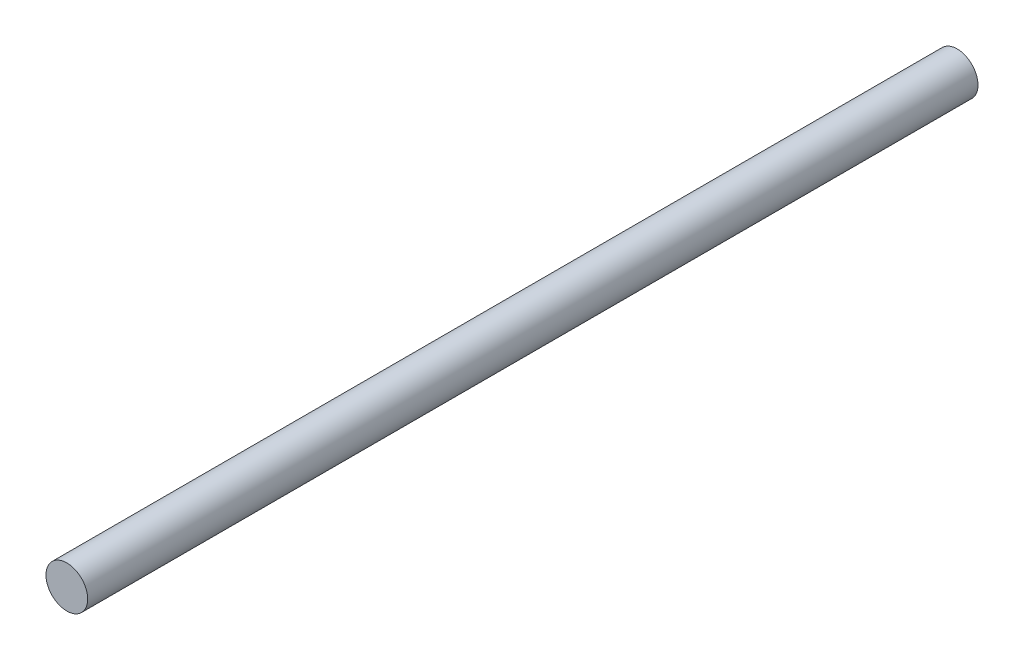
ISO-10303-21;
HEADER;
FILE_DESCRIPTION(('STEP AP214'),'2;1');
FILE_NAME('part.step','',(''),(''),'','','');
FILE_SCHEMA(('AUTOMOTIVE_DESIGN { 1 0 10303 214 1 1 1 1 }'));
ENDSEC;
DATA;
#1=APPLICATION_CONTEXT('core data for automotive mechanical design processes');
#2=APPLICATION_PROTOCOL_DEFINITION('international standard','automotive_design',2000,#1);
#3=PRODUCT_CONTEXT('',#1,'mechanical');
#4=PRODUCT('Part','Part','',(#3));
#5=PRODUCT_RELATED_PRODUCT_CATEGORY('part','',(#4));
#6=PRODUCT_DEFINITION_FORMATION('','',#4);
#7=PRODUCT_DEFINITION_CONTEXT('part definition',#1,'design');
#8=PRODUCT_DEFINITION('design','',#6,#7);
#9=PRODUCT_DEFINITION_SHAPE('','',#8);
#10=(LENGTH_UNIT() NAMED_UNIT(*) SI_UNIT(.MILLI.,.METRE.));
#11=(NAMED_UNIT(*) PLANE_ANGLE_UNIT() SI_UNIT($,.RADIAN.));
#12=(NAMED_UNIT(*) SI_UNIT($,.STERADIAN.) SOLID_ANGLE_UNIT());
#13=UNCERTAINTY_MEASURE_WITH_UNIT(LENGTH_MEASURE(1.E-05),#10,'distance_accuracy_value','');
#14=(GEOMETRIC_REPRESENTATION_CONTEXT(3) GLOBAL_UNCERTAINTY_ASSIGNED_CONTEXT((#13)) GLOBAL_UNIT_ASSIGNED_CONTEXT((#10,
#11,#12)) REPRESENTATION_CONTEXT('',''));
#15=CARTESIAN_POINT('',(0.,0.,0.));
#16=DIRECTION('',(0.,0.,1.));
#17=DIRECTION('',(1.,0.,0.));
#18=AXIS2_PLACEMENT_3D('',#15,#16,#17);
#19=CARTESIAN_POINT('',(0.,0.,101.6));
#20=DIRECTION('',(0.,0.,-1.));
#21=DIRECTION('',(-1.,0.,0.));
#22=AXIS2_PLACEMENT_3D('',#19,#20,#21);
#23=CYLINDRICAL_SURFACE('',#22,2.38125);
#24=CARTESIAN_POINT('',(0.,0.,101.6));
#25=DIRECTION('',(0.,0.,1.));
#26=DIRECTION('',(1.,0.,0.));
#27=AXIS2_PLACEMENT_3D('',#24,#25,#26);
#28=CIRCLE('',#27,2.38125);
#29=CARTESIAN_POINT('',(2.38125,0.,101.6));
#30=VERTEX_POINT('',#29);
#31=EDGE_CURVE('E10',#30,#30,#28,.T.);
#32=ORIENTED_EDGE('',*,*,#31,.F.);
#33=EDGE_LOOP('',(#32));
#34=FACE_BOUND('',#33,.T.);
#35=CARTESIAN_POINT('',(0.,0.,0.));
#36=DIRECTION('',(0.,0.,1.));
#37=DIRECTION('',(1.,0.,0.));
#38=AXIS2_PLACEMENT_3D('',#35,#36,#37);
#39=CIRCLE('',#38,2.38125);
#40=CARTESIAN_POINT('',(2.38125,0.,0.));
#41=VERTEX_POINT('',#40);
#42=EDGE_CURVE('E34',#41,#41,#39,.T.);
#43=ORIENTED_EDGE('',*,*,#42,.T.);
#44=EDGE_LOOP('',(#43));
#45=FACE_BOUND('',#44,.T.);
#46=ADVANCED_FACE('F31',(#34,#45),#23,.T.);
#47=CARTESIAN_POINT('',(0.,0.,101.6));
#48=DIRECTION('',(0.,0.,1.));
#49=DIRECTION('',(1.,0.,0.));
#50=AXIS2_PLACEMENT_3D('',#47,#48,#49);
#51=PLANE('',#50);
#52=ORIENTED_EDGE('',*,*,#31,.T.);
#53=EDGE_LOOP('',(#52));
#54=FACE_BOUND('',#53,.T.);
#55=ADVANCED_FACE('F46',(#54),#51,.T.);
#56=CARTESIAN_POINT('',(0.,0.,0.));
#57=DIRECTION('',(0.,0.,1.));
#58=DIRECTION('',(1.,0.,0.));
#59=AXIS2_PLACEMENT_3D('',#56,#57,#58);
#60=PLANE('',#59);
#61=ORIENTED_EDGE('',*,*,#42,.F.);
#62=EDGE_LOOP('',(#61));
#63=FACE_BOUND('',#62,.T.);
#64=ADVANCED_FACE('F44',(#63),#60,.F.);
#65=CLOSED_SHELL('',(#46,#55,#64));
#66=MANIFOLD_SOLID_BREP('B2',#65);
#67=ADVANCED_BREP_SHAPE_REPRESENTATION('',(#18,#66),#14);
#68=SHAPE_DEFINITION_REPRESENTATION(#9,#67);
ENDSEC;
END-ISO-10303-21;
